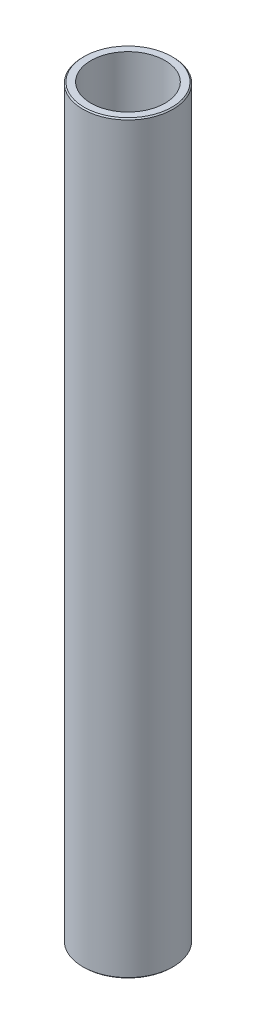
ISO-10303-21;
HEADER;
FILE_DESCRIPTION(('STEP AP214'),'2;1');
FILE_NAME('part.step','',(''),(''),'','','');
FILE_SCHEMA(('AUTOMOTIVE_DESIGN { 1 0 10303 214 1 1 1 1 }'));
ENDSEC;
DATA;
#1=APPLICATION_CONTEXT('core data for automotive mechanical design processes');
#2=APPLICATION_PROTOCOL_DEFINITION('international standard','automotive_design',2000,#1);
#3=PRODUCT_CONTEXT('',#1,'mechanical');
#4=PRODUCT('Part','Part','',(#3));
#5=PRODUCT_RELATED_PRODUCT_CATEGORY('part','',(#4));
#6=PRODUCT_DEFINITION_FORMATION('','',#4);
#7=PRODUCT_DEFINITION_CONTEXT('part definition',#1,'design');
#8=PRODUCT_DEFINITION('design','',#6,#7);
#9=PRODUCT_DEFINITION_SHAPE('','',#8);
#10=(LENGTH_UNIT() NAMED_UNIT(*) SI_UNIT(.MILLI.,.METRE.));
#11=(NAMED_UNIT(*) PLANE_ANGLE_UNIT() SI_UNIT($,.RADIAN.));
#12=(NAMED_UNIT(*) SI_UNIT($,.STERADIAN.) SOLID_ANGLE_UNIT());
#13=UNCERTAINTY_MEASURE_WITH_UNIT(LENGTH_MEASURE(1.E-05),#10,'distance_accuracy_value','');
#14=(GEOMETRIC_REPRESENTATION_CONTEXT(3) GLOBAL_UNCERTAINTY_ASSIGNED_CONTEXT((#13)) GLOBAL_UNIT_ASSIGNED_CONTEXT((#10,
#11,#12)) REPRESENTATION_CONTEXT('',''));
#15=CARTESIAN_POINT('',(0.,0.,0.));
#16=DIRECTION('',(0.,0.,1.));
#17=DIRECTION('',(1.,0.,0.));
#18=AXIS2_PLACEMENT_3D('',#15,#16,#17);
#19=CARTESIAN_POINT('',(0.,578.330826449067,0.));
#20=DIRECTION('',(0.,-1.,0.));
#21=DIRECTION('',(0.,0.,-1.));
#22=AXIS2_PLACEMENT_3D('',#19,#20,#21);
#23=CYLINDRICAL_SURFACE('',#22,35.);
#24=CARTESIAN_POINT('',(0.,577.414506192035,0.));
#25=DIRECTION('',(0.,1.,0.));
#26=DIRECTION('',(0.,0.,1.));
#27=AXIS2_PLACEMENT_3D('',#24,#25,#26);
#28=CIRCLE('',#27,35.);
#29=CARTESIAN_POINT('',(0.,577.414506192035,35.));
#30=VERTEX_POINT('',#29);
#31=EDGE_CURVE('E50',#30,#30,#28,.F.);
#32=ORIENTED_EDGE('',*,*,#31,.T.);
#33=EDGE_LOOP('',(#32));
#34=FACE_BOUND('',#33,.T.);
#35=CARTESIAN_POINT('',(0.,0.916320257032255,0.));
#36=DIRECTION('',(0.,1.,0.));
#37=DIRECTION('',(0.,0.,1.));
#38=AXIS2_PLACEMENT_3D('',#35,#36,#37);
#39=CIRCLE('',#38,35.);
#40=CARTESIAN_POINT('',(0.,0.916320257032255,35.));
#41=VERTEX_POINT('',#40);
#42=EDGE_CURVE('E51',#41,#41,#39,.T.);
#43=ORIENTED_EDGE('',*,*,#42,.T.);
#44=EDGE_LOOP('',(#43));
#45=FACE_BOUND('',#44,.T.);
#46=ADVANCED_FACE('F39',(#34,#45),#23,.T.);
#47=CARTESIAN_POINT('',(0.,578.330826449067,0.));
#48=DIRECTION('',(0.,1.,0.));
#49=DIRECTION('',(0.,0.,1.));
#50=AXIS2_PLACEMENT_3D('',#47,#48,#49);
#51=PLANE('',#50);
#52=CARTESIAN_POINT('',(0.,578.330826449067,0.));
#53=DIRECTION('',(0.,1.,0.));
#54=DIRECTION('',(0.,0.,1.));
#55=AXIS2_PLACEMENT_3D('',#52,#53,#54);
#56=CIRCLE('',#55,34.0836797429678);
#57=CARTESIAN_POINT('',(0.,578.330826449067,34.0836797429678));
#58=VERTEX_POINT('',#57);
#59=EDGE_CURVE('E54',#58,#58,#56,.T.);
#60=ORIENTED_EDGE('',*,*,#59,.T.);
#61=EDGE_LOOP('',(#60));
#62=FACE_BOUND('',#61,.T.);
#63=CARTESIAN_POINT('',(0.,578.330826449067,0.));
#64=DIRECTION('',(0.,1.,0.));
#65=DIRECTION('',(0.,0.,1.));
#66=AXIS2_PLACEMENT_3D('',#63,#64,#65);
#67=CIRCLE('',#66,28.7453006407548);
#68=CARTESIAN_POINT('',(0.,578.330826449067,28.7453006407548));
#69=VERTEX_POINT('',#68);
#70=EDGE_CURVE('E58',#69,#69,#67,.T.);
#71=ORIENTED_EDGE('',*,*,#70,.F.);
#72=EDGE_LOOP('',(#71));
#73=FACE_BOUND('',#72,.T.);
#74=ADVANCED_FACE('F69',(#62,#73),#51,.T.);
#75=CARTESIAN_POINT('',(0.,0.,0.));
#76=DIRECTION('',(0.,1.,0.));
#77=DIRECTION('',(0.,0.,1.));
#78=AXIS2_PLACEMENT_3D('',#75,#76,#77);
#79=PLANE('',#78);
#80=CARTESIAN_POINT('',(0.,0.,0.));
#81=DIRECTION('',(0.,1.,0.));
#82=DIRECTION('',(0.,0.,1.));
#83=AXIS2_PLACEMENT_3D('',#80,#81,#82);
#84=CIRCLE('',#83,34.0836797429678);
#85=CARTESIAN_POINT('',(0.,0.,34.0836797429678));
#86=VERTEX_POINT('',#85);
#87=EDGE_CURVE('E10',#86,#86,#84,.F.);
#88=ORIENTED_EDGE('',*,*,#87,.T.);
#89=EDGE_LOOP('',(#88));
#90=FACE_BOUND('',#89,.T.);
#91=CARTESIAN_POINT('',(0.,0.,0.));
#92=DIRECTION('',(0.,1.,0.));
#93=DIRECTION('',(0.,0.,1.));
#94=AXIS2_PLACEMENT_3D('',#91,#92,#93);
#95=CIRCLE('',#94,28.7453006407548);
#96=CARTESIAN_POINT('',(0.,0.,28.7453006407548));
#97=VERTEX_POINT('',#96);
#98=EDGE_CURVE('E63',#97,#97,#95,.T.);
#99=ORIENTED_EDGE('',*,*,#98,.T.);
#100=EDGE_LOOP('',(#99));
#101=FACE_BOUND('',#100,.T.);
#102=ADVANCED_FACE('F75',(#90,#101),#79,.F.);
#103=CARTESIAN_POINT('',(0.,578.330826449067,0.));
#104=DIRECTION('',(0.,-1.,0.));
#105=DIRECTION('',(0.,0.,-1.));
#106=AXIS2_PLACEMENT_3D('',#103,#104,#105);
#107=CYLINDRICAL_SURFACE('',#106,28.7453006407548);
#108=ORIENTED_EDGE('',*,*,#70,.T.);
#109=EDGE_LOOP('',(#108));
#110=FACE_BOUND('',#109,.T.);
#111=ORIENTED_EDGE('',*,*,#98,.F.);
#112=EDGE_LOOP('',(#111));
#113=FACE_BOUND('',#112,.T.);
#114=ADVANCED_FACE('F70',(#110,#113),#107,.F.);
#115=CARTESIAN_POINT('',(0.,578.330826449067,0.));
#116=DIRECTION('',(0.,-1.,0.));
#117=DIRECTION('',(0.,0.,-1.));
#118=AXIS2_PLACEMENT_3D('',#115,#116,#117);
#119=CONICAL_SURFACE('',#118,34.0836797429678,0.785398163397407);
#120=ORIENTED_EDGE('',*,*,#31,.F.);
#121=EDGE_LOOP('',(#120));
#122=FACE_BOUND('',#121,.T.);
#123=ORIENTED_EDGE('',*,*,#59,.F.);
#124=EDGE_LOOP('',(#123));
#125=FACE_BOUND('',#124,.T.);
#126=ADVANCED_FACE('F81',(#122,#125),#119,.T.);
#127=CARTESIAN_POINT('',(0.,0.916320257032255,0.));
#128=DIRECTION('',(0.,1.,0.));
#129=DIRECTION('',(0.,0.,1.));
#130=AXIS2_PLACEMENT_3D('',#127,#128,#129);
#131=CONICAL_SURFACE('',#130,35.,0.785398163397407);
#132=ORIENTED_EDGE('',*,*,#87,.F.);
#133=EDGE_LOOP('',(#132));
#134=FACE_BOUND('',#133,.T.);
#135=ORIENTED_EDGE('',*,*,#42,.F.);
#136=EDGE_LOOP('',(#135));
#137=FACE_BOUND('',#136,.T.);
#138=ADVANCED_FACE('F45',(#134,#137),#131,.T.);
#139=CLOSED_SHELL('',(#46,#74,#102,#114,#126,#138));
#140=MANIFOLD_SOLID_BREP('B2',#139);
#141=ADVANCED_BREP_SHAPE_REPRESENTATION('',(#18,#140),#14);
#142=SHAPE_DEFINITION_REPRESENTATION(#9,#141);
ENDSEC;
END-ISO-10303-21;
